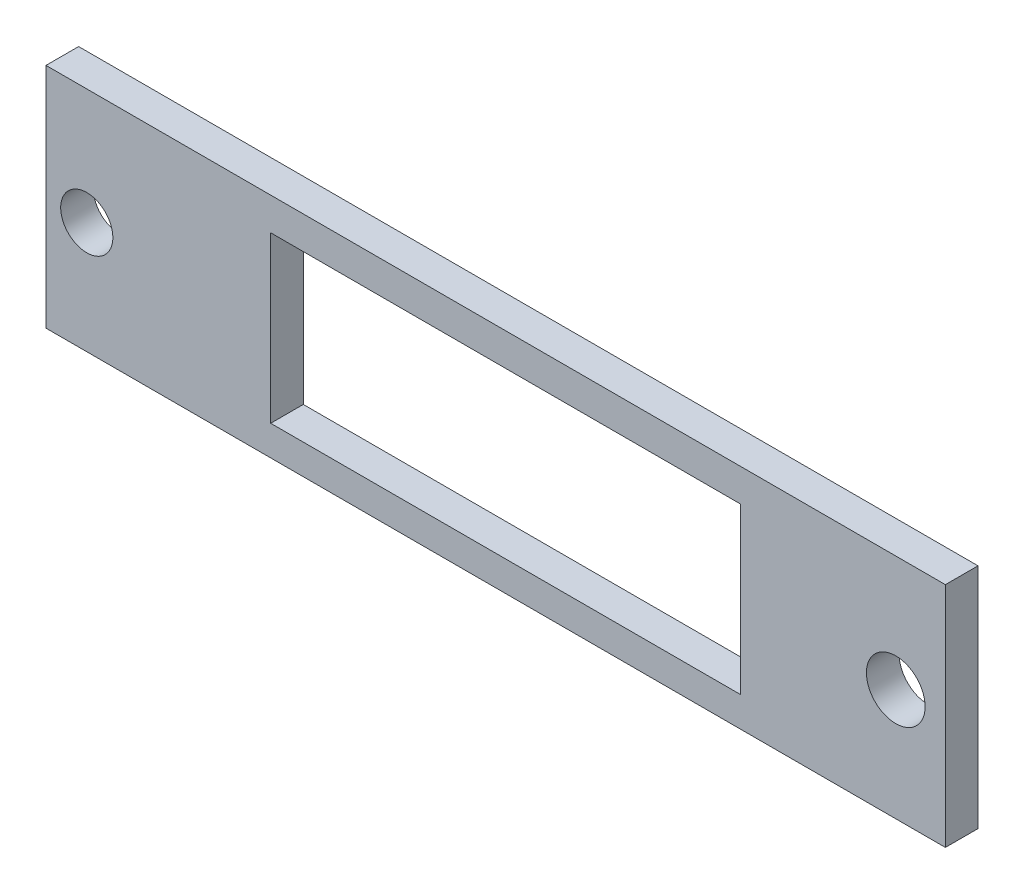
ISO-10303-21;
HEADER;
FILE_DESCRIPTION(('STEP AP214'),'2;1');
FILE_NAME('part.step','',(''),(''),'','','');
FILE_SCHEMA(('AUTOMOTIVE_DESIGN { 1 0 10303 214 1 1 1 1 }'));
ENDSEC;
DATA;
#1=APPLICATION_CONTEXT('core data for automotive mechanical design processes');
#2=APPLICATION_PROTOCOL_DEFINITION('international standard','automotive_design',2000,#1);
#3=PRODUCT_CONTEXT('',#1,'mechanical');
#4=PRODUCT('Part','Part','',(#3));
#5=PRODUCT_RELATED_PRODUCT_CATEGORY('part','',(#4));
#6=PRODUCT_DEFINITION_FORMATION('','',#4);
#7=PRODUCT_DEFINITION_CONTEXT('part definition',#1,'design');
#8=PRODUCT_DEFINITION('design','',#6,#7);
#9=PRODUCT_DEFINITION_SHAPE('','',#8);
#10=(LENGTH_UNIT() NAMED_UNIT(*) SI_UNIT(.MILLI.,.METRE.));
#11=(NAMED_UNIT(*) PLANE_ANGLE_UNIT() SI_UNIT($,.RADIAN.));
#12=(NAMED_UNIT(*) SI_UNIT($,.STERADIAN.) SOLID_ANGLE_UNIT());
#13=UNCERTAINTY_MEASURE_WITH_UNIT(LENGTH_MEASURE(1.E-05),#10,'distance_accuracy_value','');
#14=(GEOMETRIC_REPRESENTATION_CONTEXT(3) GLOBAL_UNCERTAINTY_ASSIGNED_CONTEXT((#13)) GLOBAL_UNIT_ASSIGNED_CONTEXT((#10,
#11,#12)) REPRESENTATION_CONTEXT('',''));
#15=CARTESIAN_POINT('',(0.,0.,0.));
#16=DIRECTION('',(0.,0.,1.));
#17=DIRECTION('',(1.,0.,0.));
#18=AXIS2_PLACEMENT_3D('',#15,#16,#17);
#19=CARTESIAN_POINT('',(27.8416829479435,0.,2.));
#20=DIRECTION('',(1.,0.,0.));
#21=DIRECTION('',(0.,1.,0.));
#22=AXIS2_PLACEMENT_3D('',#19,#20,#21);
#23=PLANE('',#22);
#24=DIRECTION('',(0.,-1.,0.));
#25=VECTOR('',#24,1.);
#26=CARTESIAN_POINT('',(27.8416829479435,0.,0.));
#27=LINE('',#26,#25);
#28=CARTESIAN_POINT('',(27.8416829479435,6.90000000000001,0.));
#29=VERTEX_POINT('',#28);
#30=CARTESIAN_POINT('',(27.8416829479435,-7.05496818602523,0.));
#31=VERTEX_POINT('',#30);
#32=EDGE_CURVE('E172',#29,#31,#27,.T.);
#33=ORIENTED_EDGE('',*,*,#32,.F.);
#34=DIRECTION('',(0.,0.,-1.));
#35=VECTOR('',#34,1.);
#36=CARTESIAN_POINT('',(27.8416829479435,6.90000000000001,2.));
#37=LINE('',#36,#35);
#38=CARTESIAN_POINT('',(27.8416829479435,6.90000000000001,2.));
#39=VERTEX_POINT('',#38);
#40=EDGE_CURVE('E11',#39,#29,#37,.T.);
#41=ORIENTED_EDGE('',*,*,#40,.F.);
#42=DIRECTION('',(0.,-1.,0.));
#43=VECTOR('',#42,1.);
#44=CARTESIAN_POINT('',(27.8416829479435,0.,2.));
#45=LINE('',#44,#43);
#46=CARTESIAN_POINT('',(27.8416829479435,-7.05496818602523,2.));
#47=VERTEX_POINT('',#46);
#48=EDGE_CURVE('E138',#39,#47,#45,.T.);
#49=ORIENTED_EDGE('',*,*,#48,.T.);
#50=DIRECTION('',(0.,0.,-1.));
#51=VECTOR('',#50,1.);
#52=CARTESIAN_POINT('',(27.8416829479435,-7.05496818602523,2.));
#53=LINE('',#52,#51);
#54=EDGE_CURVE('E98',#47,#31,#53,.T.);
#55=ORIENTED_EDGE('',*,*,#54,.T.);
#56=EDGE_LOOP('',(#33,#41,#49,#55));
#57=FACE_BOUND('',#56,.T.);
#58=ADVANCED_FACE('F43',(#57),#23,.T.);
#59=CARTESIAN_POINT('',(0.,6.90000000000001,2.));
#60=DIRECTION('',(0.,1.,0.));
#61=DIRECTION('',(0.,0.,1.));
#62=AXIS2_PLACEMENT_3D('',#59,#60,#61);
#63=PLANE('',#62);
#64=DIRECTION('',(1.,0.,0.));
#65=VECTOR('',#64,1.);
#66=CARTESIAN_POINT('',(0.,6.90000000000001,0.));
#67=LINE('',#66,#65);
#68=CARTESIAN_POINT('',(-27.3,6.90000000000001,0.));
#69=VERTEX_POINT('',#68);
#70=EDGE_CURVE('E126',#69,#29,#67,.T.);
#71=ORIENTED_EDGE('',*,*,#70,.F.);
#72=DIRECTION('',(0.,0.,-1.));
#73=VECTOR('',#72,1.);
#74=CARTESIAN_POINT('',(-27.3,6.90000000000001,2.));
#75=LINE('',#74,#73);
#76=CARTESIAN_POINT('',(-27.3,6.90000000000001,2.));
#77=VERTEX_POINT('',#76);
#78=EDGE_CURVE('E54',#77,#69,#75,.T.);
#79=ORIENTED_EDGE('',*,*,#78,.F.);
#80=DIRECTION('',(1.,0.,0.));
#81=VECTOR('',#80,1.);
#82=CARTESIAN_POINT('',(0.,6.90000000000001,2.));
#83=LINE('',#82,#81);
#84=EDGE_CURVE('E124',#77,#39,#83,.T.);
#85=ORIENTED_EDGE('',*,*,#84,.T.);
#86=ORIENTED_EDGE('',*,*,#40,.T.);
#87=EDGE_LOOP('',(#71,#79,#85,#86));
#88=FACE_BOUND('',#87,.T.);
#89=ADVANCED_FACE('F122',(#88),#63,.T.);
#90=CARTESIAN_POINT('',(-27.3,0.,2.));
#91=DIRECTION('',(1.,0.,0.));
#92=DIRECTION('',(0.,0.,-1.));
#93=AXIS2_PLACEMENT_3D('',#90,#91,#92);
#94=PLANE('',#93);
#95=DIRECTION('',(0.,-1.,0.));
#96=VECTOR('',#95,1.);
#97=CARTESIAN_POINT('',(-27.3,0.,0.));
#98=LINE('',#97,#96);
#99=CARTESIAN_POINT('',(-27.3,-7.05496818602522,0.));
#100=VERTEX_POINT('',#99);
#101=EDGE_CURVE('E177',#69,#100,#98,.T.);
#102=ORIENTED_EDGE('',*,*,#101,.T.);
#103=DIRECTION('',(0.,0.,-1.));
#104=VECTOR('',#103,1.);
#105=CARTESIAN_POINT('',(-27.3,-7.05496818602522,2.));
#106=LINE('',#105,#104);
#107=CARTESIAN_POINT('',(-27.3,-7.05496818602522,2.));
#108=VERTEX_POINT('',#107);
#109=EDGE_CURVE('E130',#108,#100,#106,.T.);
#110=ORIENTED_EDGE('',*,*,#109,.F.);
#111=DIRECTION('',(0.,-1.,0.));
#112=VECTOR('',#111,1.);
#113=CARTESIAN_POINT('',(-27.3,0.,2.));
#114=LINE('',#113,#112);
#115=EDGE_CURVE('E133',#77,#108,#114,.T.);
#116=ORIENTED_EDGE('',*,*,#115,.F.);
#117=ORIENTED_EDGE('',*,*,#78,.T.);
#118=EDGE_LOOP('',(#102,#110,#116,#117));
#119=FACE_BOUND('',#118,.T.);
#120=ADVANCED_FACE('F134',(#119),#94,.F.);
#121=CARTESIAN_POINT('',(0.,4.90000000000001,2.));
#122=DIRECTION('',(0.,-1.,0.));
#123=DIRECTION('',(0.,0.,-1.));
#124=AXIS2_PLACEMENT_3D('',#121,#122,#123);
#125=PLANE('',#124);
#126=DIRECTION('',(-1.,0.,0.));
#127=VECTOR('',#126,1.);
#128=CARTESIAN_POINT('',(0.,4.90000000000001,0.));
#129=LINE('',#128,#127);
#130=CARTESIAN_POINT('',(15.2708414739718,4.90000000000001,0.));
#131=VERTEX_POINT('',#130);
#132=CARTESIAN_POINT('',(-13.5246837262848,4.90000000000001,0.));
#133=VERTEX_POINT('',#132);
#134=EDGE_CURVE('E149',#131,#133,#129,.T.);
#135=ORIENTED_EDGE('',*,*,#134,.F.);
#136=DIRECTION('',(0.,0.,-1.));
#137=VECTOR('',#136,1.);
#138=CARTESIAN_POINT('',(15.2708414739718,4.90000000000001,2.));
#139=LINE('',#138,#137);
#140=CARTESIAN_POINT('',(15.2708414739718,4.90000000000001,2.));
#141=VERTEX_POINT('',#140);
#142=EDGE_CURVE('E47',#141,#131,#139,.T.);
#143=ORIENTED_EDGE('',*,*,#142,.F.);
#144=DIRECTION('',(-1.,0.,0.));
#145=VECTOR('',#144,1.);
#146=CARTESIAN_POINT('',(0.,4.90000000000001,2.));
#147=LINE('',#146,#145);
#148=CARTESIAN_POINT('',(-13.5246837262848,4.90000000000001,2.));
#149=VERTEX_POINT('',#148);
#150=EDGE_CURVE('E182',#141,#149,#147,.T.);
#151=ORIENTED_EDGE('',*,*,#150,.T.);
#152=DIRECTION('',(0.,0.,-1.));
#153=VECTOR('',#152,1.);
#154=CARTESIAN_POINT('',(-13.5246837262848,4.90000000000001,2.));
#155=LINE('',#154,#153);
#156=EDGE_CURVE('E148',#149,#133,#155,.T.);
#157=ORIENTED_EDGE('',*,*,#156,.T.);
#158=EDGE_LOOP('',(#135,#143,#151,#157));
#159=FACE_BOUND('',#158,.T.);
#160=ADVANCED_FACE('F45',(#159),#125,.T.);
#161=CARTESIAN_POINT('',(15.2708414739718,0.,2.));
#162=DIRECTION('',(1.,0.,0.));
#163=DIRECTION('',(0.,0.,-1.));
#164=AXIS2_PLACEMENT_3D('',#161,#162,#163);
#165=PLANE('',#164);
#166=DIRECTION('',(0.,-1.,0.));
#167=VECTOR('',#166,1.);
#168=CARTESIAN_POINT('',(15.2708414739718,0.,0.));
#169=LINE('',#168,#167);
#170=CARTESIAN_POINT('',(15.2708414739718,-5.21578204787687,0.));
#171=VERTEX_POINT('',#170);
#172=EDGE_CURVE('E153',#131,#171,#169,.T.);
#173=ORIENTED_EDGE('',*,*,#172,.T.);
#174=DIRECTION('',(0.,0.,-1.));
#175=VECTOR('',#174,1.);
#176=CARTESIAN_POINT('',(15.2708414739718,-5.21578204787687,2.));
#177=LINE('',#176,#175);
#178=CARTESIAN_POINT('',(15.2708414739718,-5.21578204787687,2.));
#179=VERTEX_POINT('',#178);
#180=EDGE_CURVE('E191',#179,#171,#177,.T.);
#181=ORIENTED_EDGE('',*,*,#180,.F.);
#182=DIRECTION('',(0.,-1.,0.));
#183=VECTOR('',#182,1.);
#184=CARTESIAN_POINT('',(15.2708414739718,0.,2.));
#185=LINE('',#184,#183);
#186=EDGE_CURVE('E202',#141,#179,#185,.T.);
#187=ORIENTED_EDGE('',*,*,#186,.F.);
#188=ORIENTED_EDGE('',*,*,#142,.T.);
#189=EDGE_LOOP('',(#173,#181,#187,#188));
#190=FACE_BOUND('',#189,.T.);
#191=ADVANCED_FACE('F201',(#190),#165,.F.);
#192=CARTESIAN_POINT('',(0.,-5.21578204787687,2.));
#193=DIRECTION('',(0.,-1.,0.));
#194=DIRECTION('',(0.,0.,-1.));
#195=AXIS2_PLACEMENT_3D('',#192,#193,#194);
#196=PLANE('',#195);
#197=DIRECTION('',(-1.,0.,0.));
#198=VECTOR('',#197,1.);
#199=CARTESIAN_POINT('',(0.,-5.21578204787687,0.));
#200=LINE('',#199,#198);
#201=CARTESIAN_POINT('',(-13.5246837262848,-5.21578204787687,0.));
#202=VERTEX_POINT('',#201);
#203=EDGE_CURVE('E156',#171,#202,#200,.T.);
#204=ORIENTED_EDGE('',*,*,#203,.T.);
#205=DIRECTION('',(0.,0.,-1.));
#206=VECTOR('',#205,1.);
#207=CARTESIAN_POINT('',(-13.5246837262848,-5.21578204787687,2.));
#208=LINE('',#207,#206);
#209=CARTESIAN_POINT('',(-13.5246837262848,-5.21578204787687,2.));
#210=VERTEX_POINT('',#209);
#211=EDGE_CURVE('E189',#210,#202,#208,.T.);
#212=ORIENTED_EDGE('',*,*,#211,.F.);
#213=DIRECTION('',(-1.,0.,0.));
#214=VECTOR('',#213,1.);
#215=CARTESIAN_POINT('',(0.,-5.21578204787687,2.));
#216=LINE('',#215,#214);
#217=EDGE_CURVE('E356',#179,#210,#216,.T.);
#218=ORIENTED_EDGE('',*,*,#217,.F.);
#219=ORIENTED_EDGE('',*,*,#180,.T.);
#220=EDGE_LOOP('',(#204,#212,#218,#219));
#221=FACE_BOUND('',#220,.T.);
#222=ADVANCED_FACE('F214',(#221),#196,.F.);
#223=CARTESIAN_POINT('',(24.8,-0.19999999999999,2.));
#224=DIRECTION('',(0.,0.,-1.));
#225=DIRECTION('',(-1.,0.,0.));
#226=AXIS2_PLACEMENT_3D('',#223,#224,#225);
#227=CYLINDRICAL_SURFACE('',#226,1.80000000000001);
#228=CARTESIAN_POINT('',(24.8,-0.19999999999999,2.));
#229=DIRECTION('',(0.,0.,1.));
#230=DIRECTION('',(1.,0.,0.));
#231=AXIS2_PLACEMENT_3D('',#228,#229,#230);
#232=CIRCLE('',#231,1.80000000000001);
#233=CARTESIAN_POINT('',(26.6,-0.19999999999999,2.));
#234=VERTEX_POINT('',#233);
#235=EDGE_CURVE('E142',#234,#234,#232,.T.);
#236=ORIENTED_EDGE('',*,*,#235,.T.);
#237=EDGE_LOOP('',(#236));
#238=FACE_BOUND('',#237,.T.);
#239=CARTESIAN_POINT('',(24.8,-0.19999999999999,0.));
#240=DIRECTION('',(0.,0.,1.));
#241=DIRECTION('',(1.,0.,0.));
#242=AXIS2_PLACEMENT_3D('',#239,#240,#241);
#243=CIRCLE('',#242,1.80000000000001);
#244=CARTESIAN_POINT('',(26.6,-0.19999999999999,0.));
#245=VERTEX_POINT('',#244);
#246=EDGE_CURVE('E168',#245,#245,#243,.T.);
#247=ORIENTED_EDGE('',*,*,#246,.F.);
#248=EDGE_LOOP('',(#247));
#249=FACE_BOUND('',#248,.T.);
#250=ADVANCED_FACE('F216',(#238,#249),#227,.F.);
#251=CARTESIAN_POINT('',(-24.8,-0.19999999999999,2.));
#252=DIRECTION('',(0.,0.,-1.));
#253=DIRECTION('',(-1.,0.,0.));
#254=AXIS2_PLACEMENT_3D('',#251,#252,#253);
#255=CYLINDRICAL_SURFACE('',#254,1.60000000000001);
#256=CARTESIAN_POINT('',(-24.8,-0.19999999999999,2.));
#257=DIRECTION('',(0.,0.,1.));
#258=DIRECTION('',(1.,0.,0.));
#259=AXIS2_PLACEMENT_3D('',#256,#257,#258);
#260=CIRCLE('',#259,1.60000000000001);
#261=CARTESIAN_POINT('',(-23.2,-0.19999999999999,2.));
#262=VERTEX_POINT('',#261);
#263=EDGE_CURVE('E347',#262,#262,#260,.T.);
#264=ORIENTED_EDGE('',*,*,#263,.T.);
#265=EDGE_LOOP('',(#264));
#266=FACE_BOUND('',#265,.T.);
#267=CARTESIAN_POINT('',(-24.8,-0.19999999999999,0.));
#268=DIRECTION('',(0.,0.,1.));
#269=DIRECTION('',(1.,0.,0.));
#270=AXIS2_PLACEMENT_3D('',#267,#268,#269);
#271=CIRCLE('',#270,1.60000000000001);
#272=CARTESIAN_POINT('',(-23.2,-0.19999999999999,0.));
#273=VERTEX_POINT('',#272);
#274=EDGE_CURVE('E164',#273,#273,#271,.T.);
#275=ORIENTED_EDGE('',*,*,#274,.F.);
#276=EDGE_LOOP('',(#275));
#277=FACE_BOUND('',#276,.T.);
#278=ADVANCED_FACE('F222',(#266,#277),#255,.F.);
#279=CARTESIAN_POINT('',(-13.5246837262848,0.,2.));
#280=DIRECTION('',(1.,0.,0.));
#281=DIRECTION('',(0.,0.,-1.));
#282=AXIS2_PLACEMENT_3D('',#279,#280,#281);
#283=PLANE('',#282);
#284=DIRECTION('',(0.,-1.,0.));
#285=VECTOR('',#284,1.);
#286=CARTESIAN_POINT('',(-13.5246837262848,0.,0.));
#287=LINE('',#286,#285);
#288=EDGE_CURVE('E160',#133,#202,#287,.T.);
#289=ORIENTED_EDGE('',*,*,#288,.F.);
#290=ORIENTED_EDGE('',*,*,#156,.F.);
#291=DIRECTION('',(0.,-1.,0.));
#292=VECTOR('',#291,1.);
#293=CARTESIAN_POINT('',(-13.5246837262848,0.,2.));
#294=LINE('',#293,#292);
#295=EDGE_CURVE('E212',#149,#210,#294,.T.);
#296=ORIENTED_EDGE('',*,*,#295,.T.);
#297=ORIENTED_EDGE('',*,*,#211,.T.);
#298=EDGE_LOOP('',(#289,#290,#296,#297));
#299=FACE_BOUND('',#298,.T.);
#300=ADVANCED_FACE('F211',(#299),#283,.T.);
#301=CARTESIAN_POINT('',(0.,-7.05496818602522,2.));
#302=DIRECTION('',(0.,1.,0.));
#303=DIRECTION('',(-1.,0.,0.));
#304=AXIS2_PLACEMENT_3D('',#301,#302,#303);
#305=PLANE('',#304);
#306=DIRECTION('',(1.,0.,0.));
#307=VECTOR('',#306,1.);
#308=CARTESIAN_POINT('',(0.,-7.05496818602522,0.));
#309=LINE('',#308,#307);
#310=EDGE_CURVE('E91',#100,#31,#309,.T.);
#311=ORIENTED_EDGE('',*,*,#310,.T.);
#312=ORIENTED_EDGE('',*,*,#54,.F.);
#313=DIRECTION('',(1.,0.,0.));
#314=VECTOR('',#313,1.);
#315=CARTESIAN_POINT('',(0.,-7.05496818602522,2.));
#316=LINE('',#315,#314);
#317=EDGE_CURVE('E63',#108,#47,#316,.T.);
#318=ORIENTED_EDGE('',*,*,#317,.F.);
#319=ORIENTED_EDGE('',*,*,#109,.T.);
#320=EDGE_LOOP('',(#311,#312,#318,#319));
#321=FACE_BOUND('',#320,.T.);
#322=ADVANCED_FACE('F237',(#321),#305,.F.);
#323=CARTESIAN_POINT('',(0.,0.,2.));
#324=DIRECTION('',(0.,0.,1.));
#325=DIRECTION('',(1.,0.,0.));
#326=AXIS2_PLACEMENT_3D('',#323,#324,#325);
#327=PLANE('',#326);
#328=ORIENTED_EDGE('',*,*,#150,.F.);
#329=ORIENTED_EDGE('',*,*,#186,.T.);
#330=ORIENTED_EDGE('',*,*,#217,.T.);
#331=ORIENTED_EDGE('',*,*,#295,.F.);
#332=EDGE_LOOP('',(#328,#329,#330,#331));
#333=FACE_BOUND('',#332,.T.);
#334=ORIENTED_EDGE('',*,*,#263,.F.);
#335=EDGE_LOOP('',(#334));
#336=FACE_BOUND('',#335,.T.);
#337=ORIENTED_EDGE('',*,*,#235,.F.);
#338=EDGE_LOOP('',(#337));
#339=FACE_BOUND('',#338,.T.);
#340=ORIENTED_EDGE('',*,*,#48,.F.);
#341=ORIENTED_EDGE('',*,*,#84,.F.);
#342=ORIENTED_EDGE('',*,*,#115,.T.);
#343=ORIENTED_EDGE('',*,*,#317,.T.);
#344=EDGE_LOOP('',(#340,#341,#342,#343));
#345=FACE_BOUND('',#344,.T.);
#346=ADVANCED_FACE('F137',(#333,#336,#339,#345),#327,.T.);
#347=CARTESIAN_POINT('',(0.,0.,0.));
#348=DIRECTION('',(0.,0.,1.));
#349=DIRECTION('',(1.,0.,0.));
#350=AXIS2_PLACEMENT_3D('',#347,#348,#349);
#351=PLANE('',#350);
#352=ORIENTED_EDGE('',*,*,#134,.T.);
#353=ORIENTED_EDGE('',*,*,#288,.T.);
#354=ORIENTED_EDGE('',*,*,#203,.F.);
#355=ORIENTED_EDGE('',*,*,#172,.F.);
#356=EDGE_LOOP('',(#352,#353,#354,#355));
#357=FACE_BOUND('',#356,.T.);
#358=ORIENTED_EDGE('',*,*,#274,.T.);
#359=EDGE_LOOP('',(#358));
#360=FACE_BOUND('',#359,.T.);
#361=ORIENTED_EDGE('',*,*,#246,.T.);
#362=EDGE_LOOP('',(#361));
#363=FACE_BOUND('',#362,.T.);
#364=ORIENTED_EDGE('',*,*,#32,.T.);
#365=ORIENTED_EDGE('',*,*,#310,.F.);
#366=ORIENTED_EDGE('',*,*,#101,.F.);
#367=ORIENTED_EDGE('',*,*,#70,.T.);
#368=EDGE_LOOP('',(#364,#365,#366,#367));
#369=FACE_BOUND('',#368,.T.);
#370=ADVANCED_FACE('F205',(#357,#360,#363,#369),#351,.F.);
#371=CLOSED_SHELL('',(#58,#89,#120,#160,#191,#222,#250,#278,#300,#322,#346,#370));
#372=MANIFOLD_SOLID_BREP('B2',#371);
#373=ADVANCED_BREP_SHAPE_REPRESENTATION('',(#18,#372),#14);
#374=SHAPE_DEFINITION_REPRESENTATION(#9,#373);
ENDSEC;
END-ISO-10303-21;
